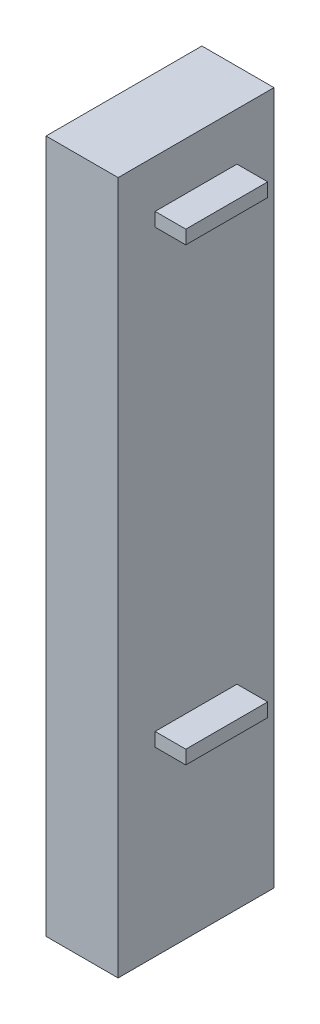
ISO-10303-21;
HEADER;
FILE_DESCRIPTION(('STEP AP214'),'2;1');
FILE_NAME('part.step','',(''),(''),'','','');
FILE_SCHEMA(('AUTOMOTIVE_DESIGN { 1 0 10303 214 1 1 1 1 }'));
ENDSEC;
DATA;
#1=APPLICATION_CONTEXT('core data for automotive mechanical design processes');
#2=APPLICATION_PROTOCOL_DEFINITION('international standard','automotive_design',2000,#1);
#3=PRODUCT_CONTEXT('',#1,'mechanical');
#4=PRODUCT('Part','Part','',(#3));
#5=PRODUCT_RELATED_PRODUCT_CATEGORY('part','',(#4));
#6=PRODUCT_DEFINITION_FORMATION('','',#4);
#7=PRODUCT_DEFINITION_CONTEXT('part definition',#1,'design');
#8=PRODUCT_DEFINITION('design','',#6,#7);
#9=PRODUCT_DEFINITION_SHAPE('','',#8);
#10=(LENGTH_UNIT() NAMED_UNIT(*) SI_UNIT(.MILLI.,.METRE.));
#11=(NAMED_UNIT(*) PLANE_ANGLE_UNIT() SI_UNIT($,.RADIAN.));
#12=(NAMED_UNIT(*) SI_UNIT($,.STERADIAN.) SOLID_ANGLE_UNIT());
#13=UNCERTAINTY_MEASURE_WITH_UNIT(LENGTH_MEASURE(1.E-05),#10,'distance_accuracy_value','');
#14=(GEOMETRIC_REPRESENTATION_CONTEXT(3) GLOBAL_UNCERTAINTY_ASSIGNED_CONTEXT((#13)) GLOBAL_UNIT_ASSIGNED_CONTEXT((#10,
#11,#12)) REPRESENTATION_CONTEXT('',''));
#15=CARTESIAN_POINT('',(0.,0.,0.));
#16=DIRECTION('',(0.,0.,1.));
#17=DIRECTION('',(1.,0.,0.));
#18=AXIS2_PLACEMENT_3D('',#15,#16,#17);
#19=CARTESIAN_POINT('',(124.206,1188.466,0.));
#20=DIRECTION('',(1.,0.,0.));
#21=DIRECTION('',(0.,0.,-1.));
#22=AXIS2_PLACEMENT_3D('',#19,#20,#21);
#23=PLANE('',#22);
#24=DIRECTION('',(0.,0.,-1.));
#25=VECTOR('',#24,1.);
#26=CARTESIAN_POINT('',(124.206,1175.766,76.2));
#27=LINE('',#26,#25);
#28=CARTESIAN_POINT('',(124.206,1175.766,-76.2));
#29=VERTEX_POINT('',#28);
#30=CARTESIAN_POINT('',(124.206,1175.766,76.2));
#31=VERTEX_POINT('',#30);
#32=EDGE_CURVE('E101',#29,#31,#27,.F.);
#33=ORIENTED_EDGE('',*,*,#32,.F.);
#34=DIRECTION('',(0.,1.,0.));
#35=VECTOR('',#34,1.);
#36=CARTESIAN_POINT('',(124.206,1175.766,-76.2));
#37=LINE('',#36,#35);
#38=CARTESIAN_POINT('',(124.206,1201.166,-76.2));
#39=VERTEX_POINT('',#38);
#40=EDGE_CURVE('E18',#39,#29,#37,.F.);
#41=ORIENTED_EDGE('',*,*,#40,.F.);
#42=DIRECTION('',(0.,0.,1.));
#43=VECTOR('',#42,1.);
#44=CARTESIAN_POINT('',(124.206,1201.166,-76.2));
#45=LINE('',#44,#43);
#46=CARTESIAN_POINT('',(124.206,1201.166,76.2));
#47=VERTEX_POINT('',#46);
#48=EDGE_CURVE('E128',#47,#39,#45,.F.);
#49=ORIENTED_EDGE('',*,*,#48,.F.);
#50=DIRECTION('',(0.,-1.,0.));
#51=VECTOR('',#50,1.);
#52=CARTESIAN_POINT('',(124.206,1201.166,76.2));
#53=LINE('',#52,#51);
#54=EDGE_CURVE('E114',#31,#47,#53,.F.);
#55=ORIENTED_EDGE('',*,*,#54,.F.);
#56=EDGE_LOOP('',(#33,#41,#49,#55));
#57=FACE_BOUND('',#56,.T.);
#58=ADVANCED_FACE('F15',(#57),#23,.T.);
#59=CARTESIAN_POINT('',(124.206,350.266,0.));
#60=DIRECTION('',(1.,0.,0.));
#61=DIRECTION('',(0.,0.,-1.));
#62=AXIS2_PLACEMENT_3D('',#59,#60,#61);
#63=PLANE('',#62);
#64=DIRECTION('',(0.,0.,1.));
#65=VECTOR('',#64,1.);
#66=CARTESIAN_POINT('',(124.206,362.966,-76.2));
#67=LINE('',#66,#65);
#68=CARTESIAN_POINT('',(124.206,362.966,76.2));
#69=VERTEX_POINT('',#68);
#70=CARTESIAN_POINT('',(124.206,362.966,-76.2));
#71=VERTEX_POINT('',#70);
#72=EDGE_CURVE('E136',#69,#71,#67,.F.);
#73=ORIENTED_EDGE('',*,*,#72,.F.);
#74=DIRECTION('',(0.,1.,0.));
#75=VECTOR('',#74,1.);
#76=CARTESIAN_POINT('',(124.206,362.966,76.2));
#77=LINE('',#76,#75);
#78=CARTESIAN_POINT('',(124.206,337.566,76.2));
#79=VERTEX_POINT('',#78);
#80=EDGE_CURVE('E131',#79,#69,#77,.T.);
#81=ORIENTED_EDGE('',*,*,#80,.F.);
#82=DIRECTION('',(0.,0.,-1.));
#83=VECTOR('',#82,1.);
#84=CARTESIAN_POINT('',(124.206,337.566,76.2));
#85=LINE('',#84,#83);
#86=CARTESIAN_POINT('',(124.206,337.566,-76.2));
#87=VERTEX_POINT('',#86);
#88=EDGE_CURVE('E146',#87,#79,#85,.F.);
#89=ORIENTED_EDGE('',*,*,#88,.F.);
#90=DIRECTION('',(0.,1.,0.));
#91=VECTOR('',#90,1.);
#92=CARTESIAN_POINT('',(124.206,337.566,-76.2));
#93=LINE('',#92,#91);
#94=EDGE_CURVE('E141',#71,#87,#93,.F.);
#95=ORIENTED_EDGE('',*,*,#94,.F.);
#96=EDGE_LOOP('',(#73,#81,#89,#95));
#97=FACE_BOUND('',#96,.T.);
#98=ADVANCED_FACE('F338',(#97),#63,.T.);
#99=CARTESIAN_POINT('',(67.056,1175.766,-76.2));
#100=DIRECTION('',(0.,0.,-1.));
#101=DIRECTION('',(-1.,0.,0.));
#102=AXIS2_PLACEMENT_3D('',#99,#100,#101);
#103=PLANE('',#102);
#104=ORIENTED_EDGE('',*,*,#40,.T.);
#105=DIRECTION('',(1.,0.,0.));
#106=VECTOR('',#105,1.);
#107=CARTESIAN_POINT('',(67.056,1175.766,-76.2));
#108=LINE('',#107,#106);
#109=CARTESIAN_POINT('',(67.056,1175.766,-76.2));
#110=VERTEX_POINT('',#109);
#111=EDGE_CURVE('E107',#110,#29,#108,.T.);
#112=ORIENTED_EDGE('',*,*,#111,.F.);
#113=DIRECTION('',(0.,1.,0.));
#114=VECTOR('',#113,1.);
#115=CARTESIAN_POINT('',(67.0560000000001,0.,-76.2));
#116=LINE('',#115,#114);
#117=CARTESIAN_POINT('',(67.056,1201.166,-76.2));
#118=VERTEX_POINT('',#117);
#119=EDGE_CURVE('E152',#118,#110,#116,.F.);
#120=ORIENTED_EDGE('',*,*,#119,.F.);
#121=DIRECTION('',(1.,0.,0.));
#122=VECTOR('',#121,1.);
#123=CARTESIAN_POINT('',(67.056,1201.166,-76.2));
#124=LINE('',#123,#122);
#125=EDGE_CURVE('E110',#39,#118,#124,.F.);
#126=ORIENTED_EDGE('',*,*,#125,.F.);
#127=EDGE_LOOP('',(#104,#112,#120,#126));
#128=FACE_BOUND('',#127,.T.);
#129=ADVANCED_FACE('F106',(#128),#103,.T.);
#130=CARTESIAN_POINT('',(67.056,1175.766,76.2));
#131=DIRECTION('',(0.,-1.,0.));
#132=DIRECTION('',(0.,0.,-1.));
#133=AXIS2_PLACEMENT_3D('',#130,#131,#132);
#134=PLANE('',#133);
#135=ORIENTED_EDGE('',*,*,#32,.T.);
#136=DIRECTION('',(1.,0.,0.));
#137=VECTOR('',#136,1.);
#138=CARTESIAN_POINT('',(67.056,1175.766,76.2));
#139=LINE('',#138,#137);
#140=CARTESIAN_POINT('',(67.056,1175.766,76.2));
#141=VERTEX_POINT('',#140);
#142=EDGE_CURVE('E116',#141,#31,#139,.T.);
#143=ORIENTED_EDGE('',*,*,#142,.F.);
#144=DIRECTION('',(0.,0.,-1.));
#145=VECTOR('',#144,1.);
#146=CARTESIAN_POINT('',(67.056,1175.766,145.034));
#147=LINE('',#146,#145);
#148=EDGE_CURVE('E120',#110,#141,#147,.F.);
#149=ORIENTED_EDGE('',*,*,#148,.F.);
#150=ORIENTED_EDGE('',*,*,#111,.T.);
#151=EDGE_LOOP('',(#135,#143,#149,#150));
#152=FACE_BOUND('',#151,.T.);
#153=ADVANCED_FACE('F118',(#152),#134,.T.);
#154=CARTESIAN_POINT('',(67.056,1201.166,76.2));
#155=DIRECTION('',(0.,0.,1.));
#156=DIRECTION('',(0.,-1.,0.));
#157=AXIS2_PLACEMENT_3D('',#154,#155,#156);
#158=PLANE('',#157);
#159=ORIENTED_EDGE('',*,*,#54,.T.);
#160=DIRECTION('',(1.,0.,0.));
#161=VECTOR('',#160,1.);
#162=CARTESIAN_POINT('',(67.056,1201.166,76.2));
#163=LINE('',#162,#161);
#164=CARTESIAN_POINT('',(67.056,1201.166,76.2));
#165=VERTEX_POINT('',#164);
#166=EDGE_CURVE('E125',#165,#47,#163,.T.);
#167=ORIENTED_EDGE('',*,*,#166,.F.);
#168=DIRECTION('',(0.,1.,0.));
#169=VECTOR('',#168,1.);
#170=CARTESIAN_POINT('',(67.056,0.,76.2));
#171=LINE('',#170,#169);
#172=EDGE_CURVE('E155',#141,#165,#171,.T.);
#173=ORIENTED_EDGE('',*,*,#172,.F.);
#174=ORIENTED_EDGE('',*,*,#142,.T.);
#175=EDGE_LOOP('',(#159,#167,#173,#174));
#176=FACE_BOUND('',#175,.T.);
#177=ADVANCED_FACE('F314',(#176),#158,.T.);
#178=CARTESIAN_POINT('',(67.056,1201.166,-76.2));
#179=DIRECTION('',(0.,1.,0.));
#180=DIRECTION('',(0.,0.,1.));
#181=AXIS2_PLACEMENT_3D('',#178,#179,#180);
#182=PLANE('',#181);
#183=ORIENTED_EDGE('',*,*,#48,.T.);
#184=ORIENTED_EDGE('',*,*,#125,.T.);
#185=DIRECTION('',(0.,0.,-1.));
#186=VECTOR('',#185,1.);
#187=CARTESIAN_POINT('',(67.056,1201.166,145.034));
#188=LINE('',#187,#186);
#189=EDGE_CURVE('E158',#165,#118,#188,.T.);
#190=ORIENTED_EDGE('',*,*,#189,.F.);
#191=ORIENTED_EDGE('',*,*,#166,.T.);
#192=EDGE_LOOP('',(#183,#184,#190,#191));
#193=FACE_BOUND('',#192,.T.);
#194=ADVANCED_FACE('F305',(#193),#182,.T.);
#195=CARTESIAN_POINT('',(67.056,362.966,76.2));
#196=DIRECTION('',(0.,0.,1.));
#197=DIRECTION('',(1.,0.,0.));
#198=AXIS2_PLACEMENT_3D('',#195,#196,#197);
#199=PLANE('',#198);
#200=ORIENTED_EDGE('',*,*,#80,.T.);
#201=DIRECTION('',(1.,0.,0.));
#202=VECTOR('',#201,1.);
#203=CARTESIAN_POINT('',(67.056,362.966,76.2));
#204=LINE('',#203,#202);
#205=CARTESIAN_POINT('',(67.056,362.966,76.2));
#206=VERTEX_POINT('',#205);
#207=EDGE_CURVE('E133',#206,#69,#204,.T.);
#208=ORIENTED_EDGE('',*,*,#207,.F.);
#209=DIRECTION('',(0.,1.,0.));
#210=VECTOR('',#209,1.);
#211=CARTESIAN_POINT('',(67.056,0.,76.2));
#212=LINE('',#211,#210);
#213=CARTESIAN_POINT('',(67.056,337.566,76.2));
#214=VERTEX_POINT('',#213);
#215=EDGE_CURVE('E161',#214,#206,#212,.T.);
#216=ORIENTED_EDGE('',*,*,#215,.F.);
#217=DIRECTION('',(1.,0.,0.));
#218=VECTOR('',#217,1.);
#219=CARTESIAN_POINT('',(67.056,337.566,76.2));
#220=LINE('',#219,#218);
#221=EDGE_CURVE('E149',#79,#214,#220,.F.);
#222=ORIENTED_EDGE('',*,*,#221,.F.);
#223=EDGE_LOOP('',(#200,#208,#216,#222));
#224=FACE_BOUND('',#223,.T.);
#225=ADVANCED_FACE('F296',(#224),#199,.T.);
#226=CARTESIAN_POINT('',(67.056,362.966,-76.2));
#227=DIRECTION('',(0.,1.,0.));
#228=DIRECTION('',(0.,0.,1.));
#229=AXIS2_PLACEMENT_3D('',#226,#227,#228);
#230=PLANE('',#229);
#231=ORIENTED_EDGE('',*,*,#72,.T.);
#232=DIRECTION('',(-1.,0.,0.));
#233=VECTOR('',#232,1.);
#234=CARTESIAN_POINT('',(67.056,362.966,-76.2));
#235=LINE('',#234,#233);
#236=CARTESIAN_POINT('',(67.056,362.966,-76.2));
#237=VERTEX_POINT('',#236);
#238=EDGE_CURVE('E138',#237,#71,#235,.F.);
#239=ORIENTED_EDGE('',*,*,#238,.F.);
#240=DIRECTION('',(0.,0.,-1.));
#241=VECTOR('',#240,1.);
#242=CARTESIAN_POINT('',(67.056,362.966,145.034));
#243=LINE('',#242,#241);
#244=EDGE_CURVE('E164',#206,#237,#243,.T.);
#245=ORIENTED_EDGE('',*,*,#244,.F.);
#246=ORIENTED_EDGE('',*,*,#207,.T.);
#247=EDGE_LOOP('',(#231,#239,#245,#246));
#248=FACE_BOUND('',#247,.T.);
#249=ADVANCED_FACE('F287',(#248),#230,.T.);
#250=CARTESIAN_POINT('',(67.056,337.566,-76.2));
#251=DIRECTION('',(0.,0.,-1.));
#252=DIRECTION('',(-1.,0.,0.));
#253=AXIS2_PLACEMENT_3D('',#250,#251,#252);
#254=PLANE('',#253);
#255=ORIENTED_EDGE('',*,*,#94,.T.);
#256=DIRECTION('',(1.,0.,0.));
#257=VECTOR('',#256,1.);
#258=CARTESIAN_POINT('',(67.056,337.566,-76.2));
#259=LINE('',#258,#257);
#260=CARTESIAN_POINT('',(67.056,337.566,-76.2));
#261=VERTEX_POINT('',#260);
#262=EDGE_CURVE('E143',#261,#87,#259,.T.);
#263=ORIENTED_EDGE('',*,*,#262,.F.);
#264=DIRECTION('',(0.,1.,0.));
#265=VECTOR('',#264,1.);
#266=CARTESIAN_POINT('',(67.0560000000001,0.,-76.2));
#267=LINE('',#266,#265);
#268=EDGE_CURVE('E167',#237,#261,#267,.F.);
#269=ORIENTED_EDGE('',*,*,#268,.F.);
#270=ORIENTED_EDGE('',*,*,#238,.T.);
#271=EDGE_LOOP('',(#255,#263,#269,#270));
#272=FACE_BOUND('',#271,.T.);
#273=ADVANCED_FACE('F278',(#272),#254,.T.);
#274=CARTESIAN_POINT('',(67.056,337.566,76.2));
#275=DIRECTION('',(0.,-1.,0.));
#276=DIRECTION('',(0.,0.,-1.));
#277=AXIS2_PLACEMENT_3D('',#274,#275,#276);
#278=PLANE('',#277);
#279=ORIENTED_EDGE('',*,*,#88,.T.);
#280=ORIENTED_EDGE('',*,*,#221,.T.);
#281=DIRECTION('',(0.,0.,-1.));
#282=VECTOR('',#281,1.);
#283=CARTESIAN_POINT('',(67.056,337.566,145.034));
#284=LINE('',#283,#282);
#285=EDGE_CURVE('E170',#261,#214,#284,.F.);
#286=ORIENTED_EDGE('',*,*,#285,.F.);
#287=ORIENTED_EDGE('',*,*,#262,.T.);
#288=EDGE_LOOP('',(#279,#280,#286,#287));
#289=FACE_BOUND('',#288,.T.);
#290=ADVANCED_FACE('F223',(#289),#278,.T.);
#291=CARTESIAN_POINT('',(67.056,0.,145.034));
#292=DIRECTION('',(1.,0.,0.));
#293=DIRECTION('',(0.,0.,-1.));
#294=AXIS2_PLACEMENT_3D('',#291,#292,#293);
#295=PLANE('',#294);
#296=ORIENTED_EDGE('',*,*,#268,.T.);
#297=ORIENTED_EDGE('',*,*,#285,.T.);
#298=ORIENTED_EDGE('',*,*,#215,.T.);
#299=ORIENTED_EDGE('',*,*,#244,.T.);
#300=EDGE_LOOP('',(#296,#297,#298,#299));
#301=FACE_BOUND('',#300,.T.);
#302=ORIENTED_EDGE('',*,*,#172,.T.);
#303=ORIENTED_EDGE('',*,*,#189,.T.);
#304=ORIENTED_EDGE('',*,*,#119,.T.);
#305=ORIENTED_EDGE('',*,*,#148,.T.);
#306=EDGE_LOOP('',(#302,#303,#304,#305));
#307=FACE_BOUND('',#306,.T.);
#308=DIRECTION('',(0.,0.,1.));
#309=VECTOR('',#308,1.);
#310=CARTESIAN_POINT('',(67.056,1290.066,0.));
#311=LINE('',#310,#309);
#312=CARTESIAN_POINT('',(67.056,1290.066,145.034));
#313=VERTEX_POINT('',#312);
#314=CARTESIAN_POINT('',(67.056,1290.066,-145.034));
#315=VERTEX_POINT('',#314);
#316=EDGE_CURVE('E183',#313,#315,#311,.F.);
#317=ORIENTED_EDGE('',*,*,#316,.F.);
#318=DIRECTION('',(0.,1.,0.));
#319=VECTOR('',#318,1.);
#320=CARTESIAN_POINT('',(67.056,0.,145.034));
#321=LINE('',#320,#319);
#322=CARTESIAN_POINT('',(67.056,0.,145.034));
#323=VERTEX_POINT('',#322);
#324=EDGE_CURVE('E178',#323,#313,#321,.T.);
#325=ORIENTED_EDGE('',*,*,#324,.F.);
#326=DIRECTION('',(0.,0.,1.));
#327=VECTOR('',#326,1.);
#328=CARTESIAN_POINT('',(67.056,0.,0.));
#329=LINE('',#328,#327);
#330=CARTESIAN_POINT('',(67.056,0.,-145.034));
#331=VERTEX_POINT('',#330);
#332=EDGE_CURVE('E173',#323,#331,#329,.F.);
#333=ORIENTED_EDGE('',*,*,#332,.T.);
#334=DIRECTION('',(0.,1.,0.));
#335=VECTOR('',#334,1.);
#336=CARTESIAN_POINT('',(67.056,0.,-145.034));
#337=LINE('',#336,#335);
#338=EDGE_CURVE('E189',#315,#331,#337,.F.);
#339=ORIENTED_EDGE('',*,*,#338,.F.);
#340=EDGE_LOOP('',(#317,#325,#333,#339));
#341=FACE_BOUND('',#340,.T.);
#342=ADVANCED_FACE('F209',(#301,#307,#341),#295,.T.);
#343=CARTESIAN_POINT('',(0.,0.,0.));
#344=DIRECTION('',(0.,1.,0.));
#345=DIRECTION('',(0.,0.,1.));
#346=AXIS2_PLACEMENT_3D('',#343,#344,#345);
#347=PLANE('',#346);
#348=DIRECTION('',(0.,0.,1.));
#349=VECTOR('',#348,1.);
#350=CARTESIAN_POINT('',(-67.056,0.,-145.034));
#351=LINE('',#350,#349);
#352=CARTESIAN_POINT('',(-67.056,0.,-145.034));
#353=VERTEX_POINT('',#352);
#354=CARTESIAN_POINT('',(-67.056,0.,145.034));
#355=VERTEX_POINT('',#354);
#356=EDGE_CURVE('E192',#353,#355,#351,.T.);
#357=ORIENTED_EDGE('',*,*,#356,.F.);
#358=DIRECTION('',(-1.,0.,0.));
#359=VECTOR('',#358,1.);
#360=CARTESIAN_POINT('',(67.056,0.,-145.034));
#361=LINE('',#360,#359);
#362=EDGE_CURVE('E185',#331,#353,#361,.T.);
#363=ORIENTED_EDGE('',*,*,#362,.F.);
#364=ORIENTED_EDGE('',*,*,#332,.F.);
#365=DIRECTION('',(1.,0.,0.));
#366=VECTOR('',#365,1.);
#367=CARTESIAN_POINT('',(-67.056,0.,145.034));
#368=LINE('',#367,#366);
#369=EDGE_CURVE('E175',#355,#323,#368,.T.);
#370=ORIENTED_EDGE('',*,*,#369,.F.);
#371=EDGE_LOOP('',(#357,#363,#364,#370));
#372=FACE_BOUND('',#371,.T.);
#373=ADVANCED_FACE('F214',(#372),#347,.F.);
#374=CARTESIAN_POINT('',(-67.056,0.,145.034));
#375=DIRECTION('',(0.,0.,1.));
#376=DIRECTION('',(1.,0.,0.));
#377=AXIS2_PLACEMENT_3D('',#374,#375,#376);
#378=PLANE('',#377);
#379=DIRECTION('',(1.,0.,0.));
#380=VECTOR('',#379,1.);
#381=CARTESIAN_POINT('',(0.,1290.066,145.034));
#382=LINE('',#381,#380);
#383=CARTESIAN_POINT('',(-67.056,1290.066,145.034));
#384=VERTEX_POINT('',#383);
#385=EDGE_CURVE('E180',#384,#313,#382,.T.);
#386=ORIENTED_EDGE('',*,*,#385,.F.);
#387=DIRECTION('',(0.,1.,0.));
#388=VECTOR('',#387,1.);
#389=CARTESIAN_POINT('',(-67.056,0.,145.034));
#390=LINE('',#389,#388);
#391=EDGE_CURVE('E195',#355,#384,#390,.T.);
#392=ORIENTED_EDGE('',*,*,#391,.F.);
#393=ORIENTED_EDGE('',*,*,#369,.T.);
#394=ORIENTED_EDGE('',*,*,#324,.T.);
#395=EDGE_LOOP('',(#386,#392,#393,#394));
#396=FACE_BOUND('',#395,.T.);
#397=ADVANCED_FACE('F206',(#396),#378,.T.);
#398=CARTESIAN_POINT('',(0.,1290.066,0.));
#399=DIRECTION('',(0.,1.,0.));
#400=DIRECTION('',(0.,0.,1.));
#401=AXIS2_PLACEMENT_3D('',#398,#399,#400);
#402=PLANE('',#401);
#403=DIRECTION('',(-1.,0.,0.));
#404=VECTOR('',#403,1.);
#405=CARTESIAN_POINT('',(67.056,1290.066,-145.034));
#406=LINE('',#405,#404);
#407=CARTESIAN_POINT('',(-67.056,1290.066,-145.034));
#408=VERTEX_POINT('',#407);
#409=EDGE_CURVE('E33',#408,#315,#406,.F.);
#410=ORIENTED_EDGE('',*,*,#409,.F.);
#411=DIRECTION('',(0.,0.,1.));
#412=VECTOR('',#411,1.);
#413=CARTESIAN_POINT('',(-67.056,1290.066,-145.034));
#414=LINE('',#413,#412);
#415=EDGE_CURVE('E24',#384,#408,#414,.F.);
#416=ORIENTED_EDGE('',*,*,#415,.F.);
#417=ORIENTED_EDGE('',*,*,#385,.T.);
#418=ORIENTED_EDGE('',*,*,#316,.T.);
#419=EDGE_LOOP('',(#410,#416,#417,#418));
#420=FACE_BOUND('',#419,.T.);
#421=ADVANCED_FACE('F202',(#420),#402,.T.);
#422=CARTESIAN_POINT('',(67.056,0.,-145.034));
#423=DIRECTION('',(0.,0.,-1.));
#424=DIRECTION('',(-1.,0.,0.));
#425=AXIS2_PLACEMENT_3D('',#422,#423,#424);
#426=PLANE('',#425);
#427=ORIENTED_EDGE('',*,*,#409,.T.);
#428=ORIENTED_EDGE('',*,*,#338,.T.);
#429=ORIENTED_EDGE('',*,*,#362,.T.);
#430=DIRECTION('',(0.,1.,0.));
#431=VECTOR('',#430,1.);
#432=CARTESIAN_POINT('',(-67.056,0.,-145.034));
#433=LINE('',#432,#431);
#434=EDGE_CURVE('E10',#408,#353,#433,.F.);
#435=ORIENTED_EDGE('',*,*,#434,.F.);
#436=EDGE_LOOP('',(#427,#428,#429,#435));
#437=FACE_BOUND('',#436,.T.);
#438=ADVANCED_FACE('F212',(#437),#426,.T.);
#439=CARTESIAN_POINT('',(-67.056,0.,-145.034));
#440=DIRECTION('',(-1.,0.,0.));
#441=DIRECTION('',(0.,0.,1.));
#442=AXIS2_PLACEMENT_3D('',#439,#440,#441);
#443=PLANE('',#442);
#444=ORIENTED_EDGE('',*,*,#415,.T.);
#445=ORIENTED_EDGE('',*,*,#434,.T.);
#446=ORIENTED_EDGE('',*,*,#356,.T.);
#447=ORIENTED_EDGE('',*,*,#391,.T.);
#448=EDGE_LOOP('',(#444,#445,#446,#447));
#449=FACE_BOUND('',#448,.T.);
#450=ADVANCED_FACE('F200',(#449),#443,.T.);
#451=CLOSED_SHELL('',(#58,#98,#129,#153,#177,#194,#225,#249,#273,#290,#342,#373,#397,#421,#438,#450));
#452=MANIFOLD_SOLID_BREP('B1',#451);
#453=ADVANCED_BREP_SHAPE_REPRESENTATION('',(#18,#452),#14);
#454=SHAPE_DEFINITION_REPRESENTATION(#9,#453);
ENDSEC;
END-ISO-10303-21;
